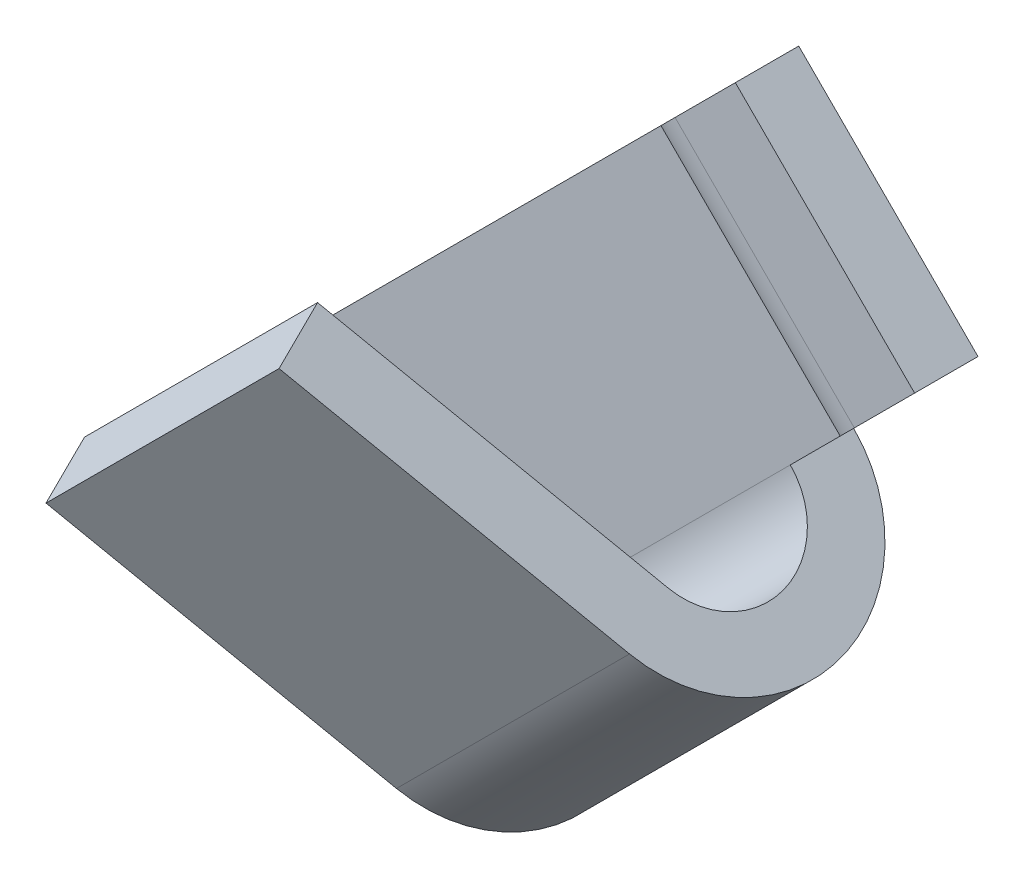
ISO-10303-21;
HEADER;
FILE_DESCRIPTION(('STEP AP214'),'2;1');
FILE_NAME('part.step','',(''),(''),'','','');
FILE_SCHEMA(('AUTOMOTIVE_DESIGN { 1 0 10303 214 1 1 1 1 }'));
ENDSEC;
DATA;
#1=APPLICATION_CONTEXT('core data for automotive mechanical design processes');
#2=APPLICATION_PROTOCOL_DEFINITION('international standard','automotive_design',2000,#1);
#3=PRODUCT_CONTEXT('',#1,'mechanical');
#4=PRODUCT('Part','Part','',(#3));
#5=PRODUCT_RELATED_PRODUCT_CATEGORY('part','',(#4));
#6=PRODUCT_DEFINITION_FORMATION('','',#4);
#7=PRODUCT_DEFINITION_CONTEXT('part definition',#1,'design');
#8=PRODUCT_DEFINITION('design','',#6,#7);
#9=PRODUCT_DEFINITION_SHAPE('','',#8);
#10=(LENGTH_UNIT() NAMED_UNIT(*) SI_UNIT(.MILLI.,.METRE.));
#11=(NAMED_UNIT(*) PLANE_ANGLE_UNIT() SI_UNIT($,.RADIAN.));
#12=(NAMED_UNIT(*) SI_UNIT($,.STERADIAN.) SOLID_ANGLE_UNIT());
#13=UNCERTAINTY_MEASURE_WITH_UNIT(LENGTH_MEASURE(1.E-05),#10,'distance_accuracy_value','');
#14=(GEOMETRIC_REPRESENTATION_CONTEXT(3) GLOBAL_UNCERTAINTY_ASSIGNED_CONTEXT((#13)) GLOBAL_UNIT_ASSIGNED_CONTEXT((#10,
#11,#12)) REPRESENTATION_CONTEXT('',''));
#15=CARTESIAN_POINT('',(0.,0.,0.));
#16=DIRECTION('',(0.,0.,1.));
#17=DIRECTION('',(1.,0.,0.));
#18=AXIS2_PLACEMENT_3D('',#15,#16,#17);
#19=CARTESIAN_POINT('',(-5.307476720611,-6.014583501798,0.338229496468));
#20=DIRECTION('',(-0.707106781186548,-0.707106781186548,0.));
#21=DIRECTION('',(0.707106781186548,-0.707106781186548,0.));
#22=AXIS2_PLACEMENT_3D('',#19,#20,#21);
#23=CYLINDRICAL_SURFACE('',#22,0.3);
#24=DIRECTION('',(0.707106781186932,0.707106781186163,0.));
#25=VECTOR('',#24,1.);
#26=CARTESIAN_POINT('',(-5.651394788552,-6.358501569738,0.03822949646826));
#27=LINE('',#26,#25);
#28=CARTESIAN_POINT('',(-5.651394788552,-6.358501569738,0.03822949646813));
#29=VERTEX_POINT('',#28);
#30=CARTESIAN_POINT('',(-4.732155973009,-5.439262754196,0.0382294964681299));
#31=VERTEX_POINT('',#30);
#32=EDGE_CURVE('E144',#29,#31,#27,.T.);
#33=ORIENTED_EDGE('',*,*,#32,.F.);
#34=CARTESIAN_POINT('',(-5.6513947885515,-6.3585015697385,0.338229496468));
#35=DIRECTION('',(-0.707106781186548,-0.707106781186548,0.));
#36=DIRECTION('',(0.707106781186548,-0.707106781186548,0.));
#37=AXIS2_PLACEMENT_3D('',#34,#35,#36);
#38=CIRCLE('',#37,0.3);
#39=CARTESIAN_POINT('',(-5.56174391693263,-6.44815244135737,0.610121832579192));
#40=VERTEX_POINT('',#39);
#41=EDGE_CURVE('E20',#40,#29,#38,.F.);
#42=ORIENTED_EDGE('',*,*,#41,.F.);
#43=DIRECTION('',(-0.707106781186864,-0.707106781186231,2.08667218119905E-13));
#44=VECTOR('',#43,1.);
#45=CARTESIAN_POINT('',(-4.64250510138985,-5.52891362581515,0.610121832579443));
#46=LINE('',#45,#44);
#47=CARTESIAN_POINT('',(-4.64250510138993,-5.52891362581507,0.610121832579221));
#48=VERTEX_POINT('',#47);
#49=EDGE_CURVE('E141',#48,#40,#46,.T.);
#50=ORIENTED_EDGE('',*,*,#49,.F.);
#51=CARTESIAN_POINT('',(-4.732155973009,-5.439262754196,0.338229496468));
#52=DIRECTION('',(-0.707106781186548,-0.707106781186548,0.));
#53=DIRECTION('',(0.707106781186548,-0.707106781186548,0.));
#54=AXIS2_PLACEMENT_3D('',#51,#52,#53);
#55=CIRCLE('',#54,0.3);
#56=EDGE_CURVE('E163',#31,#48,#55,.T.);
#57=ORIENTED_EDGE('',*,*,#56,.F.);
#58=EDGE_LOOP('',(#33,#42,#50,#57));
#59=FACE_BOUND('',#58,.T.);
#60=ADVANCED_FACE('F17',(#59),#23,.F.);
#61=CARTESIAN_POINT('',(-6.394857213605,-5.615039144685,1.159525572842));
#62=DIRECTION('',(-0.298836238729927,0.298836238729927,-0.906307787036777));
#63=DIRECTION('',(0.,0.949705125315019,0.313145613014751));
#64=AXIS2_PLACEMENT_3D('',#61,#62,#63);
#65=PLANE('',#64);
#66=DIRECTION('',(0.707106781186548,0.707106781186548,0.));
#67=VECTOR('',#66,1.);
#68=CARTESIAN_POINT('',(-5.47561839806291,-4.69580032914209,1.15952557284227));
#69=LINE('',#68,#67);
#70=CARTESIAN_POINT('',(-6.39485721360514,-5.61503914468486,1.15952557284209));
#71=VERTEX_POINT('',#70);
#72=CARTESIAN_POINT('',(-5.47561839806297,-4.69580032914203,1.15952557284209));
#73=VERTEX_POINT('',#72);
#74=EDGE_CURVE('E158',#71,#73,#69,.T.);
#75=ORIENTED_EDGE('',*,*,#74,.T.);
#76=DIRECTION('',(-0.640856382055835,0.640856382055835,0.422618261740559));
#77=VECTOR('',#76,1.);
#78=CARTESIAN_POINT('',(-4.64250510139,-5.528913625815,0.610121832579));
#79=LINE('',#78,#77);
#80=EDGE_CURVE('E156',#48,#73,#79,.T.);
#81=ORIENTED_EDGE('',*,*,#80,.F.);
#82=ORIENTED_EDGE('',*,*,#49,.T.);
#83=DIRECTION('',(0.640856382055697,-0.640856382055697,-0.422618261740976));
#84=VECTOR('',#83,1.);
#85=CARTESIAN_POINT('',(-6.394857213605,-5.615039144685,1.159525572842));
#86=LINE('',#85,#84);
#87=EDGE_CURVE('E153',#71,#40,#86,.T.);
#88=ORIENTED_EDGE('',*,*,#87,.F.);
#89=EDGE_LOOP('',(#75,#81,#82,#88));
#90=FACE_BOUND('',#89,.T.);
#91=ADVANCED_FACE('F152',(#90),#65,.T.);
#92=CARTESIAN_POINT('',(-5.475618398063,-4.695800329142,1.159525572842));
#93=DIRECTION('',(0.640856382055745,-0.640856382055745,-0.422618261740832));
#94=DIRECTION('',(0.707106781186548,0.707106781186548,0.));
#95=AXIS2_PLACEMENT_3D('',#92,#93,#94);
#96=PLANE('',#95);
#97=DIRECTION('',(-0.298836238728551,0.298836238728551,-0.906307787037684));
#98=VECTOR('',#97,1.);
#99=CARTESIAN_POINT('',(-6.320148153923,-5.689748204367,1.386102519601));
#100=LINE('',#99,#98);
#101=CARTESIAN_POINT('',(-6.320148153923,-5.689748204367,1.386102519601));
#102=VERTEX_POINT('',#101);
#103=EDGE_CURVE('E162',#102,#71,#100,.T.);
#104=ORIENTED_EDGE('',*,*,#103,.F.);
#105=DIRECTION('',(-0.707106781186548,-0.707106781186547,0.));
#106=VECTOR('',#105,1.);
#107=CARTESIAN_POINT('',(-5.400909338381,-4.770509388825,1.386102519601));
#108=LINE('',#107,#106);
#109=CARTESIAN_POINT('',(-5.40090933838083,-4.77050938882483,1.386102519601));
#110=VERTEX_POINT('',#109);
#111=EDGE_CURVE('E177',#110,#102,#108,.T.);
#112=ORIENTED_EDGE('',*,*,#111,.F.);
#113=DIRECTION('',(0.298836238730198,-0.298836238730198,0.906307787036598));
#114=VECTOR('',#113,1.);
#115=CARTESIAN_POINT('',(-5.475618398063,-4.695800329142,1.159525572842));
#116=LINE('',#115,#114);
#117=EDGE_CURVE('E231',#73,#110,#116,.T.);
#118=ORIENTED_EDGE('',*,*,#117,.F.);
#119=ORIENTED_EDGE('',*,*,#74,.F.);
#120=EDGE_LOOP('',(#104,#112,#118,#119));
#121=FACE_BOUND('',#120,.T.);
#122=ADVANCED_FACE('F317',(#121),#96,.F.);
#123=CARTESIAN_POINT('',(-5.934237501026,-6.641344282213,0.03822949646826));
#124=DIRECTION('',(0.,0.,1.));
#125=DIRECTION('',(1.,0.,0.));
#126=AXIS2_PLACEMENT_3D('',#123,#124,#125);
#127=PLANE('',#126);
#128=DIRECTION('',(0.707106781186549,0.707106781186546,0.));
#129=VECTOR('',#128,1.);
#130=CARTESIAN_POINT('',(-4.732155973009,-5.439262754196,0.03822949646826));
#131=LINE('',#130,#129);
#132=CARTESIAN_POINT('',(-4.520023938653,-5.22713071984,0.03822949646813));
#133=VERTEX_POINT('',#132);
#134=EDGE_CURVE('E210',#31,#133,#131,.T.);
#135=ORIENTED_EDGE('',*,*,#134,.T.);
#136=DIRECTION('',(0.707106781186548,-0.707106781186548,0.));
#137=VECTOR('',#136,1.);
#138=CARTESIAN_POINT('',(-4.520023938653,-5.22713071984,0.038229496468));
#139=LINE('',#138,#137);
#140=CARTESIAN_POINT('',(-5.22713071984,-4.520023938653,0.0382294964681299));
#141=VERTEX_POINT('',#140);
#142=EDGE_CURVE('E198',#133,#141,#139,.F.);
#143=ORIENTED_EDGE('',*,*,#142,.T.);
#144=DIRECTION('',(-0.707106781186548,-0.707106781186548,0.));
#145=VECTOR('',#144,1.);
#146=CARTESIAN_POINT('',(-3.207106781187,-2.5,0.0382294964682599));
#147=LINE('',#146,#145);
#148=CARTESIAN_POINT('',(-6.641344282213,-5.934237501026,0.03822949646826));
#149=VERTEX_POINT('',#148);
#150=EDGE_CURVE('E282',#149,#141,#147,.F.);
#151=ORIENTED_EDGE('',*,*,#150,.F.);
#152=DIRECTION('',(0.707106781186548,-0.707106781186548,0.));
#153=VECTOR('',#152,1.);
#154=CARTESIAN_POINT('',(-6.641344282213,-5.934237501026,0.03822949646826));
#155=LINE('',#154,#153);
#156=CARTESIAN_POINT('',(-5.934237501026,-6.641344282213,0.03822949646826));
#157=VERTEX_POINT('',#156);
#158=EDGE_CURVE('E218',#149,#157,#155,.T.);
#159=ORIENTED_EDGE('',*,*,#158,.T.);
#160=DIRECTION('',(0.707106781185297,0.707106781187798,0.));
#161=VECTOR('',#160,1.);
#162=CARTESIAN_POINT('',(-5.934237501026,-6.641344282213,0.03822949646826));
#163=LINE('',#162,#161);
#164=EDGE_CURVE('E221',#157,#29,#163,.T.);
#165=ORIENTED_EDGE('',*,*,#164,.T.);
#166=ORIENTED_EDGE('',*,*,#32,.T.);
#167=EDGE_LOOP('',(#135,#143,#151,#159,#165,#166));
#168=FACE_BOUND('',#167,.T.);
#169=ADVANCED_FACE('F354',(#168),#127,.T.);
#170=CARTESIAN_POINT('',(-7.5,-1.267083322705,21.289254270812));
#171=DIRECTION('',(-0.707106781186548,-0.707106781186548,0.));
#172=DIRECTION('',(0.707106781186548,-0.707106781186548,0.));
#173=AXIS2_PLACEMENT_3D('',#170,#171,#172);
#174=PLANE('',#173);
#175=DIRECTION('',(0.707106781186548,-0.707106781186548,0.));
#176=VECTOR('',#175,1.);
#177=CARTESIAN_POINT('',(-4.737095051946,-4.029988270759,0.));
#178=LINE('',#177,#176);
#179=CARTESIAN_POINT('',(-4.737095051946,-4.029988270759,0.));
#180=VERTEX_POINT('',#179);
#181=CARTESIAN_POINT('',(-4.029988270759,-4.737095051946,2.14708170224546E-13));
#182=VERTEX_POINT('',#181);
#183=EDGE_CURVE('E184',#180,#182,#178,.T.);
#184=ORIENTED_EDGE('',*,*,#183,.F.);
#185=DIRECTION('',(0.,0.,1.));
#186=VECTOR('',#185,1.);
#187=CARTESIAN_POINT('',(-4.737095051946,-4.029988270759,0.25));
#188=LINE('',#187,#186);
#189=CARTESIAN_POINT('',(-4.737095051946,-4.029988270759,0.25));
#190=VERTEX_POINT('',#189);
#191=EDGE_CURVE('E176',#190,#180,#188,.F.);
#192=ORIENTED_EDGE('',*,*,#191,.F.);
#193=DIRECTION('',(0.707106781186548,-0.707106781186548,0.));
#194=VECTOR('',#193,1.);
#195=CARTESIAN_POINT('',(-4.737095051946,-4.029988270759,0.25));
#196=LINE('',#195,#194);
#197=CARTESIAN_POINT('',(-4.029988270759,-4.737095051946,0.25));
#198=VERTEX_POINT('',#197);
#199=EDGE_CURVE('E208',#190,#198,#196,.T.);
#200=ORIENTED_EDGE('',*,*,#199,.T.);
#201=DIRECTION('',(0.,0.,1.));
#202=VECTOR('',#201,1.);
#203=CARTESIAN_POINT('',(-4.029988270759,-4.737095051946,0.25));
#204=LINE('',#203,#202);
#205=EDGE_CURVE('E190',#182,#198,#204,.T.);
#206=ORIENTED_EDGE('',*,*,#205,.F.);
#207=EDGE_LOOP('',(#184,#192,#200,#206));
#208=FACE_BOUND('',#207,.T.);
#209=ADVANCED_FACE('F375',(#208),#174,.F.);
#210=CARTESIAN_POINT('',(3.207106781187,-2.5,0.25));
#211=DIRECTION('',(0.,0.,-1.));
#212=DIRECTION('',(-1.,0.,0.));
#213=AXIS2_PLACEMENT_3D('',#210,#211,#212);
#214=PLANE('',#213);
#215=ORIENTED_EDGE('',*,*,#199,.F.);
#216=DIRECTION('',(-0.707106781186548,-0.707106781186548,0.));
#217=VECTOR('',#216,1.);
#218=CARTESIAN_POINT('',(-3.207106781187,-2.5,0.25));
#219=LINE('',#218,#217);
#220=CARTESIAN_POINT('',(-4.974873734153,-4.267766952966,0.250000000000161));
#221=VERTEX_POINT('',#220);
#222=EDGE_CURVE('E274',#221,#190,#219,.F.);
#223=ORIENTED_EDGE('',*,*,#222,.F.);
#224=DIRECTION('',(0.707106781186548,-0.707106781186548,0.));
#225=VECTOR('',#224,1.);
#226=CARTESIAN_POINT('',(-4.267766952966,-4.974873734153,0.250000000000322));
#227=LINE('',#226,#225);
#228=CARTESIAN_POINT('',(-4.267766952966,-4.974873734153,0.250000000000161));
#229=VERTEX_POINT('',#228);
#230=EDGE_CURVE('E206',#229,#221,#227,.F.);
#231=ORIENTED_EDGE('',*,*,#230,.F.);
#232=DIRECTION('',(0.707106781186548,0.707106781186548,0.));
#233=VECTOR('',#232,1.);
#234=CARTESIAN_POINT('',(-4.267766952966,-4.974873734153,0.25));
#235=LINE('',#234,#233);
#236=EDGE_CURVE('E193',#198,#229,#235,.F.);
#237=ORIENTED_EDGE('',*,*,#236,.F.);
#238=EDGE_LOOP('',(#215,#223,#231,#237));
#239=FACE_BOUND('',#238,.T.);
#240=ADVANCED_FACE('F373',(#239),#214,.F.);
#241=CARTESIAN_POINT('',(-4.267766952966,-4.974873734153,3.21818309848E-13));
#242=DIRECTION('',(0.707106781186548,-0.707106781186548,0.));
#243=DIRECTION('',(0.707106781186548,0.707106781186548,0.));
#244=AXIS2_PLACEMENT_3D('',#241,#242,#243);
#245=CYLINDRICAL_SURFACE('',#244,0.25);
#246=CARTESIAN_POINT('',(-4.267766952966,-4.974873734153,3.21818309848E-13));
#247=DIRECTION('',(0.707106781186548,-0.707106781186548,0.));
#248=DIRECTION('',(0.707106781186548,0.707106781186548,0.));
#249=AXIS2_PLACEMENT_3D('',#246,#247,#248);
#250=CIRCLE('',#249,0.25);
#251=CARTESIAN_POINT('',(-4.39276695296619,-5.09987373415319,0.176776695296735));
#252=VERTEX_POINT('',#251);
#253=EDGE_CURVE('E269',#229,#252,#250,.T.);
#254=ORIENTED_EDGE('',*,*,#253,.F.);
#255=ORIENTED_EDGE('',*,*,#230,.T.);
#256=CARTESIAN_POINT('',(-4.974873734153,-4.267766952966,3.21818309848E-13));
#257=DIRECTION('',(0.707106781186548,-0.707106781186548,0.));
#258=DIRECTION('',(0.707106781186548,0.707106781186548,0.));
#259=AXIS2_PLACEMENT_3D('',#256,#257,#258);
#260=CIRCLE('',#259,0.25);
#261=CARTESIAN_POINT('',(-5.09987373415319,-4.39276695296619,0.176776695296735));
#262=VERTEX_POINT('',#261);
#263=EDGE_CURVE('E275',#262,#221,#260,.F.);
#264=ORIENTED_EDGE('',*,*,#263,.F.);
#265=DIRECTION('',(-0.707106781186547,0.707106781186547,0.));
#266=VECTOR('',#265,1.);
#267=CARTESIAN_POINT('',(-4.392766952966,-5.099873734153,0.176776695297));
#268=LINE('',#267,#266);
#269=EDGE_CURVE('E203',#252,#262,#268,.T.);
#270=ORIENTED_EDGE('',*,*,#269,.F.);
#271=EDGE_LOOP('',(#254,#255,#264,#270));
#272=FACE_BOUND('',#271,.T.);
#273=ADVANCED_FACE('F368',(#272),#245,.T.);
#274=CARTESIAN_POINT('',(-4.392766952966,-5.099873734153,0.176776695297));
#275=DIRECTION('',(-0.500000000001047,-0.500000000001047,0.707106781185067));
#276=DIRECTION('',(0.816496580926586,0.,0.577350269191238));
#277=AXIS2_PLACEMENT_3D('',#274,#275,#276);
#278=PLANE('',#277);
#279=DIRECTION('',(-0.499999999998558,-0.499999999998558,-0.707106781188587));
#280=VECTOR('',#279,1.);
#281=CARTESIAN_POINT('',(-4.392766952966,-5.099873734153,0.176776695297));
#282=LINE('',#281,#280);
#283=CARTESIAN_POINT('',(-4.47002393865293,-5.17713071983993,0.0675188183496497));
#284=VERTEX_POINT('',#283);
#285=EDGE_CURVE('E268',#252,#284,#282,.T.);
#286=ORIENTED_EDGE('',*,*,#285,.F.);
#287=ORIENTED_EDGE('',*,*,#269,.T.);
#288=DIRECTION('',(0.499999999998558,0.499999999998558,0.707106781188587));
#289=VECTOR('',#288,1.);
#290=CARTESIAN_POINT('',(-5.17713071984,-4.470023938653,0.0675188183497499));
#291=LINE('',#290,#289);
#292=CARTESIAN_POINT('',(-5.17713071983993,-4.47002393865293,0.0675188183496497));
#293=VERTEX_POINT('',#292);
#294=EDGE_CURVE('E278',#293,#262,#291,.T.);
#295=ORIENTED_EDGE('',*,*,#294,.F.);
#296=DIRECTION('',(0.707106781186548,-0.707106781186548,0.));
#297=VECTOR('',#296,1.);
#298=CARTESIAN_POINT('',(-4.47002393865286,-5.17713071983986,0.0675188183495473));
#299=LINE('',#298,#297);
#300=EDGE_CURVE('E201',#293,#284,#299,.T.);
#301=ORIENTED_EDGE('',*,*,#300,.T.);
#302=EDGE_LOOP('',(#286,#287,#295,#301));
#303=FACE_BOUND('',#302,.T.);
#304=ADVANCED_FACE('F363',(#303),#278,.T.);
#305=CARTESIAN_POINT('',(-4.520023938653,-5.22713071984,0.138229496468));
#306=DIRECTION('',(0.707106781186548,-0.707106781186548,0.));
#307=DIRECTION('',(0.707106781186548,0.707106781186548,0.));
#308=AXIS2_PLACEMENT_3D('',#305,#306,#307);
#309=CYLINDRICAL_SURFACE('',#308,0.1);
#310=ORIENTED_EDGE('',*,*,#142,.F.);
#311=CARTESIAN_POINT('',(-4.520023938653,-5.22713071984,0.138229496468));
#312=DIRECTION('',(0.707106781186548,-0.707106781186548,0.));
#313=DIRECTION('',(0.707106781186548,0.707106781186548,0.));
#314=AXIS2_PLACEMENT_3D('',#311,#312,#313);
#315=CIRCLE('',#314,0.1);
#316=EDGE_CURVE('E265',#284,#133,#315,.F.);
#317=ORIENTED_EDGE('',*,*,#316,.F.);
#318=ORIENTED_EDGE('',*,*,#300,.F.);
#319=CARTESIAN_POINT('',(-5.22713071984,-4.520023938653,0.138229496468));
#320=DIRECTION('',(0.707106781186548,-0.707106781186548,0.));
#321=DIRECTION('',(0.707106781186548,0.707106781186548,0.));
#322=AXIS2_PLACEMENT_3D('',#319,#320,#321);
#323=CIRCLE('',#322,0.1);
#324=EDGE_CURVE('E279',#141,#293,#323,.T.);
#325=ORIENTED_EDGE('',*,*,#324,.F.);
#326=EDGE_LOOP('',(#310,#317,#318,#325));
#327=FACE_BOUND('',#326,.T.);
#328=ADVANCED_FACE('F358',(#327),#309,.F.);
#329=CARTESIAN_POINT('',(-4.311397712254,-5.018504493441,-0.02555830705379));
#330=DIRECTION('',(0.500000000001047,0.500000000001047,-0.707106781185067));
#331=DIRECTION('',(-0.816496580926586,0.,-0.577350269191238));
#332=AXIS2_PLACEMENT_3D('',#329,#330,#331);
#333=PLANE('',#332);
#334=DIRECTION('',(0.499999999997506,0.499999999997506,0.707106781190074));
#335=VECTOR('',#334,1.);
#336=CARTESIAN_POINT('',(-4.3912929238255,-5.0983997050125,-0.138547198828));
#337=LINE('',#336,#335);
#338=CARTESIAN_POINT('',(-4.39129292382543,-5.09839970501193,-0.138547198827513));
#339=VERTEX_POINT('',#338);
#340=CARTESIAN_POINT('',(-4.31139771225386,-5.01850449344086,-0.0255583070538812));
#341=VERTEX_POINT('',#340);
#342=EDGE_CURVE('E260',#339,#341,#337,.T.);
#343=ORIENTED_EDGE('',*,*,#342,.F.);
#344=DIRECTION('',(0.707106781186548,-0.707106781186548,0.));
#345=VECTOR('',#344,1.);
#346=CARTESIAN_POINT('',(-4.39129292382604,-5.09839970501204,-0.138547198827938));
#347=LINE('',#346,#345);
#348=CARTESIAN_POINT('',(-5.09839970501193,-4.39129292382543,-0.138547198827513));
#349=VERTEX_POINT('',#348);
#350=EDGE_CURVE('E194',#349,#339,#347,.T.);
#351=ORIENTED_EDGE('',*,*,#350,.F.);
#352=DIRECTION('',(-0.499999999997502,-0.499999999997507,-0.707106781190076));
#353=VECTOR('',#352,1.);
#354=CARTESIAN_POINT('',(-5.018504493441,-4.311397712254,-0.0255583070537901));
#355=LINE('',#354,#353);
#356=CARTESIAN_POINT('',(-5.01850449344086,-4.31139771225386,-0.0255583070538811));
#357=VERTEX_POINT('',#356);
#358=EDGE_CURVE('E285',#357,#349,#355,.T.);
#359=ORIENTED_EDGE('',*,*,#358,.F.);
#360=DIRECTION('',(0.707106781186548,-0.707106781186548,0.));
#361=VECTOR('',#360,1.);
#362=CARTESIAN_POINT('',(-4.3113977122538,-5.0185044934408,-0.0255583070540773));
#363=LINE('',#362,#361);
#364=EDGE_CURVE('E187',#357,#341,#363,.T.);
#365=ORIENTED_EDGE('',*,*,#364,.T.);
#366=EDGE_LOOP('',(#343,#351,#359,#365));
#367=FACE_BOUND('',#366,.T.);
#368=ADVANCED_FACE('F388',(#367),#333,.T.);
#369=CARTESIAN_POINT('',(-4.267766952966,-4.974873734153,-0.08726151857469));
#370=DIRECTION('',(0.707106781186548,-0.707106781186548,0.));
#371=DIRECTION('',(0.707106781186548,0.707106781186548,0.));
#372=AXIS2_PLACEMENT_3D('',#369,#370,#371);
#373=CYLINDRICAL_SURFACE('',#372,0.08726151857501);
#374=DIRECTION('',(-0.707106781186547,0.707106781186547,0.));
#375=VECTOR('',#374,1.);
#376=CARTESIAN_POINT('',(-4.267766952966,-4.974873734153,0.));
#377=LINE('',#376,#375);
#378=CARTESIAN_POINT('',(-4.267766952966,-4.974873734153,1.61071785249878E-13));
#379=VERTEX_POINT('',#378);
#380=CARTESIAN_POINT('',(-4.974873734153,-4.267766952966,0.));
#381=VERTEX_POINT('',#380);
#382=EDGE_CURVE('E149',#379,#381,#377,.T.);
#383=ORIENTED_EDGE('',*,*,#382,.F.);
#384=CARTESIAN_POINT('',(-4.267766952966,-4.974873734153,-0.08726151857469));
#385=DIRECTION('',(0.707106781186548,-0.707106781186548,0.));
#386=DIRECTION('',(0.707106781186548,0.707106781186548,0.));
#387=AXIS2_PLACEMENT_3D('',#384,#385,#386);
#388=CIRCLE('',#387,0.08726151857501);
#389=EDGE_CURVE('E257',#341,#379,#388,.F.);
#390=ORIENTED_EDGE('',*,*,#389,.F.);
#391=ORIENTED_EDGE('',*,*,#364,.F.);
#392=CARTESIAN_POINT('',(-4.974873734153,-4.267766952966,-0.08726151857469));
#393=DIRECTION('',(0.707106781186548,-0.707106781186548,0.));
#394=DIRECTION('',(0.707106781186548,0.707106781186548,0.));
#395=AXIS2_PLACEMENT_3D('',#392,#393,#394);
#396=CIRCLE('',#395,0.08726151857501);
#397=EDGE_CURVE('E283',#381,#357,#396,.T.);
#398=ORIENTED_EDGE('',*,*,#397,.F.);
#399=EDGE_LOOP('',(#383,#390,#391,#398));
#400=FACE_BOUND('',#399,.T.);
#401=ADVANCED_FACE('F382',(#400),#373,.F.);
#402=CARTESIAN_POINT('',(3.207106781187,-2.5,0.));
#403=DIRECTION('',(0.,0.,-1.));
#404=DIRECTION('',(-1.,0.,0.));
#405=AXIS2_PLACEMENT_3D('',#402,#403,#404);
#406=PLANE('',#405);
#407=ORIENTED_EDGE('',*,*,#382,.T.);
#408=DIRECTION('',(-0.707106781186548,-0.707106781186548,0.));
#409=VECTOR('',#408,1.);
#410=CARTESIAN_POINT('',(-3.207106781187,-2.5,0.));
#411=LINE('',#410,#409);
#412=EDGE_CURVE('E215',#180,#381,#411,.T.);
#413=ORIENTED_EDGE('',*,*,#412,.F.);
#414=ORIENTED_EDGE('',*,*,#183,.T.);
#415=DIRECTION('',(0.707106781186548,0.707106781186548,0.));
#416=VECTOR('',#415,1.);
#417=CARTESIAN_POINT('',(-4.267766952966,-4.974873734153,3.22116465445443E-13));
#418=LINE('',#417,#416);
#419=EDGE_CURVE('E256',#379,#182,#418,.T.);
#420=ORIENTED_EDGE('',*,*,#419,.F.);
#421=EDGE_LOOP('',(#407,#413,#414,#420));
#422=FACE_BOUND('',#421,.T.);
#423=ADVANCED_FACE('F379',(#422),#406,.T.);
#424=CARTESIAN_POINT('',(-5.48703485725,-6.52286150104,0.836698779338));
#425=DIRECTION('',(-0.707106781186548,-0.707106781186548,0.));
#426=DIRECTION('',(0.707106781186548,-0.707106781186548,0.));
#427=AXIS2_PLACEMENT_3D('',#424,#425,#426);
#428=PLANE('',#427);
#429=ORIENTED_EDGE('',*,*,#103,.T.);
#430=ORIENTED_EDGE('',*,*,#87,.T.);
#431=ORIENTED_EDGE('',*,*,#41,.T.);
#432=DIRECTION('',(0.,0.,1.));
#433=VECTOR('',#432,1.);
#434=CARTESIAN_POINT('',(-5.651394788552,-6.358501569738,0.836698779338));
#435=LINE('',#434,#433);
#436=CARTESIAN_POINT('',(-5.65139478855225,-6.35850156973825,-0.211770503531));
#437=VERTEX_POINT('',#436);
#438=EDGE_CURVE('E148',#29,#437,#435,.F.);
#439=ORIENTED_EDGE('',*,*,#438,.T.);
#440=CARTESIAN_POINT('',(-5.651394788552,-6.358501569739,0.338229496468));
#441=DIRECTION('',(-0.707106781186548,-0.707106781186548,0.));
#442=DIRECTION('',(0.707106781186548,-0.707106781186548,0.));
#443=AXIS2_PLACEMENT_3D('',#440,#441,#442);
#444=CIRCLE('',#443,0.549999999999);
#445=CARTESIAN_POINT('',(-5.48703485725085,-6.52286150104015,0.836698779337883));
#446=VERTEX_POINT('',#445);
#447=EDGE_CURVE('E253',#446,#437,#444,.F.);
#448=ORIENTED_EDGE('',*,*,#447,.F.);
#449=DIRECTION('',(0.640856382055493,-0.640856382056264,-0.422618261740426));
#450=VECTOR('',#449,1.);
#451=CARTESIAN_POINT('',(-6.320148153923,-5.689748204367,1.386102519601));
#452=LINE('',#451,#450);
#453=EDGE_CURVE('E173',#102,#446,#452,.T.);
#454=ORIENTED_EDGE('',*,*,#453,.F.);
#455=EDGE_LOOP('',(#429,#430,#431,#439,#448,#454));
#456=FACE_BOUND('',#455,.T.);
#457=ADVANCED_FACE('F160',(#456),#428,.T.);
#458=CARTESIAN_POINT('',(-4.64250510139,-5.528913625815,0.610121832579));
#459=DIRECTION('',(0.707106781186548,0.707106781186548,0.));
#460=DIRECTION('',(-0.707106781186548,0.707106781186548,0.));
#461=AXIS2_PLACEMENT_3D('',#458,#459,#460);
#462=PLANE('',#461);
#463=CARTESIAN_POINT('',(-4.732155973009,-5.439262754196,0.338229496468));
#464=DIRECTION('',(-0.707106781186548,-0.707106781186548,0.));
#465=DIRECTION('',(0.707106781186548,-0.707106781186548,0.));
#466=AXIS2_PLACEMENT_3D('',#463,#464,#465);
#467=CIRCLE('',#466,0.549999999999);
#468=CARTESIAN_POINT('',(-4.732155973009,-5.439262754196,-0.211770503531));
#469=VERTEX_POINT('',#468);
#470=CARTESIAN_POINT('',(-4.56779604170785,-5.60362268549715,0.836698779337882));
#471=VERTEX_POINT('',#470);
#472=EDGE_CURVE('E249',#469,#471,#467,.T.);
#473=ORIENTED_EDGE('',*,*,#472,.F.);
#474=DIRECTION('',(0.,0.,1.));
#475=VECTOR('',#474,1.);
#476=CARTESIAN_POINT('',(-4.732155973009,-5.439262754196,0.25));
#477=LINE('',#476,#475);
#478=EDGE_CURVE('E264',#31,#469,#477,.F.);
#479=ORIENTED_EDGE('',*,*,#478,.F.);
#480=ORIENTED_EDGE('',*,*,#56,.T.);
#481=ORIENTED_EDGE('',*,*,#80,.T.);
#482=ORIENTED_EDGE('',*,*,#117,.T.);
#483=DIRECTION('',(-0.640856382056263,0.640856382055494,0.422618261740426));
#484=VECTOR('',#483,1.);
#485=CARTESIAN_POINT('',(-4.56779604170785,-5.60362268549715,0.836698779338443));
#486=LINE('',#485,#484);
#487=EDGE_CURVE('E228',#471,#110,#486,.T.);
#488=ORIENTED_EDGE('',*,*,#487,.F.);
#489=EDGE_LOOP('',(#473,#479,#480,#481,#482,#488));
#490=FACE_BOUND('',#489,.T.);
#491=ADVANCED_FACE('F312',(#490),#462,.T.);
#492=CARTESIAN_POINT('',(-5.400909338381,-4.770509388825,1.386102519601));
#493=DIRECTION('',(0.298836238729927,-0.298836238729927,0.906307787036777));
#494=DIRECTION('',(0.,-0.949705125315019,-0.313145613014751));
#495=AXIS2_PLACEMENT_3D('',#492,#493,#494);
#496=PLANE('',#495);
#497=ORIENTED_EDGE('',*,*,#111,.T.);
#498=ORIENTED_EDGE('',*,*,#453,.T.);
#499=DIRECTION('',(-0.707106781186548,-0.707106781186548,0.));
#500=VECTOR('',#499,1.);
#501=CARTESIAN_POINT('',(-5.14311678931016,-6.17894343309884,0.83669877933753));
#502=LINE('',#501,#500);
#503=EDGE_CURVE('E252',#471,#446,#502,.T.);
#504=ORIENTED_EDGE('',*,*,#503,.F.);
#505=ORIENTED_EDGE('',*,*,#487,.T.);
#506=EDGE_LOOP('',(#497,#498,#504,#505));
#507=FACE_BOUND('',#506,.T.);
#508=ADVANCED_FACE('F309',(#507),#496,.T.);
#509=CARTESIAN_POINT('',(-3.207106781187,-2.5,0.25));
#510=DIRECTION('',(-0.707106781186548,0.707106781186548,0.));
#511=DIRECTION('',(-0.707106781186548,-0.707106781186548,0.));
#512=AXIS2_PLACEMENT_3D('',#509,#510,#511);
#513=PLANE('',#512);
#514=ORIENTED_EDGE('',*,*,#263,.T.);
#515=ORIENTED_EDGE('',*,*,#222,.T.);
#516=ORIENTED_EDGE('',*,*,#191,.T.);
#517=ORIENTED_EDGE('',*,*,#412,.T.);
#518=ORIENTED_EDGE('',*,*,#397,.T.);
#519=ORIENTED_EDGE('',*,*,#358,.T.);
#520=CARTESIAN_POINT('',(-5.223399705012,-4.516292923826,0.03822949646876));
#521=DIRECTION('',(0.707106781186548,-0.707106781186548,0.));
#522=DIRECTION('',(0.707106781186548,0.707106781186548,0.));
#523=AXIS2_PLACEMENT_3D('',#520,#521,#522);
#524=CIRCLE('',#523,0.25);
#525=CARTESIAN_POINT('',(-5.223399705012,-4.516292923826,-0.211770503531));
#526=VERTEX_POINT('',#525);
#527=EDGE_CURVE('E200',#526,#349,#524,.T.);
#528=ORIENTED_EDGE('',*,*,#527,.F.);
#529=DIRECTION('',(0.707106781186797,0.707106781186298,0.));
#530=VECTOR('',#529,1.);
#531=CARTESIAN_POINT('',(-6.641344282213,-5.934237501026,-0.211770503531));
#532=LINE('',#531,#530);
#533=CARTESIAN_POINT('',(-6.641344282213,-5.934237501026,-0.211770503531));
#534=VERTEX_POINT('',#533);
#535=EDGE_CURVE('E245',#534,#526,#532,.T.);
#536=ORIENTED_EDGE('',*,*,#535,.F.);
#537=DIRECTION('',(0.,0.,1.));
#538=VECTOR('',#537,1.);
#539=CARTESIAN_POINT('',(-6.641344282213,-5.934237501026,0.03822949646826));
#540=LINE('',#539,#538);
#541=EDGE_CURVE('E246',#149,#534,#540,.F.);
#542=ORIENTED_EDGE('',*,*,#541,.F.);
#543=ORIENTED_EDGE('',*,*,#150,.T.);
#544=ORIENTED_EDGE('',*,*,#324,.T.);
#545=ORIENTED_EDGE('',*,*,#294,.T.);
#546=EDGE_LOOP('',(#514,#515,#516,#517,#518,#519,#528,#536,#542,#543,#544,#545));
#547=FACE_BOUND('',#546,.T.);
#548=ADVANCED_FACE('F351',(#547),#513,.T.);
#549=CARTESIAN_POINT('',(-4.516292923826,-5.223399705012,0.03822949646876));
#550=DIRECTION('',(0.707106781186548,-0.707106781186548,0.));
#551=DIRECTION('',(0.707106781186548,0.707106781186548,0.));
#552=AXIS2_PLACEMENT_3D('',#549,#550,#551);
#553=CYLINDRICAL_SURFACE('',#552,0.25);
#554=CARTESIAN_POINT('',(-4.516292923826,-5.223399705012,0.03822949646876));
#555=DIRECTION('',(0.707106781186548,-0.707106781186548,0.));
#556=DIRECTION('',(0.707106781186548,0.707106781186548,0.));
#557=AXIS2_PLACEMENT_3D('',#554,#555,#556);
#558=CIRCLE('',#557,0.25);
#559=CARTESIAN_POINT('',(-4.516292923826,-5.223399705012,-0.211770503531));
#560=VERTEX_POINT('',#559);
#561=EDGE_CURVE('E261',#560,#339,#558,.T.);
#562=ORIENTED_EDGE('',*,*,#561,.F.);
#563=DIRECTION('',(0.707106781186547,-0.707106781186547,0.));
#564=VECTOR('',#563,1.);
#565=CARTESIAN_POINT('',(-5.223399705012,-4.516292923826,-0.211770503531));
#566=LINE('',#565,#564);
#567=EDGE_CURVE('E331',#526,#560,#566,.T.);
#568=ORIENTED_EDGE('',*,*,#567,.F.);
#569=ORIENTED_EDGE('',*,*,#527,.T.);
#570=ORIENTED_EDGE('',*,*,#350,.T.);
#571=EDGE_LOOP('',(#562,#568,#569,#570));
#572=FACE_BOUND('',#571,.T.);
#573=ADVANCED_FACE('F390',(#572),#553,.T.);
#574=CARTESIAN_POINT('',(-4.267766952966,-4.974873734153,0.25));
#575=DIRECTION('',(0.707106781186548,-0.707106781186548,0.));
#576=DIRECTION('',(0.707106781186548,0.707106781186548,0.));
#577=AXIS2_PLACEMENT_3D('',#574,#575,#576);
#578=PLANE('',#577);
#579=ORIENTED_EDGE('',*,*,#389,.T.);
#580=ORIENTED_EDGE('',*,*,#419,.T.);
#581=ORIENTED_EDGE('',*,*,#205,.T.);
#582=ORIENTED_EDGE('',*,*,#236,.T.);
#583=ORIENTED_EDGE('',*,*,#253,.T.);
#584=ORIENTED_EDGE('',*,*,#285,.T.);
#585=ORIENTED_EDGE('',*,*,#316,.T.);
#586=ORIENTED_EDGE('',*,*,#134,.F.);
#587=ORIENTED_EDGE('',*,*,#478,.T.);
#588=DIRECTION('',(-0.70710678118491,-0.707106781188186,0.));
#589=VECTOR('',#588,1.);
#590=CARTESIAN_POINT('',(-4.516292923826,-5.223399705012,-0.211770503531));
#591=LINE('',#590,#589);
#592=EDGE_CURVE('E324',#560,#469,#591,.T.);
#593=ORIENTED_EDGE('',*,*,#592,.F.);
#594=ORIENTED_EDGE('',*,*,#561,.T.);
#595=ORIENTED_EDGE('',*,*,#342,.T.);
#596=EDGE_LOOP('',(#579,#580,#581,#582,#583,#584,#585,#586,#587,#593,#594,#595));
#597=FACE_BOUND('',#596,.T.);
#598=ADVANCED_FACE('F406',(#597),#578,.T.);
#599=CARTESIAN_POINT('',(-5.307476720611,-6.014583501798,0.338229496468));
#600=DIRECTION('',(-0.707106781186548,-0.707106781186548,0.));
#601=DIRECTION('',(0.707106781186548,-0.707106781186548,0.));
#602=AXIS2_PLACEMENT_3D('',#599,#600,#601);
#603=CYLINDRICAL_SURFACE('',#602,0.549999999999);
#604=ORIENTED_EDGE('',*,*,#472,.T.);
#605=ORIENTED_EDGE('',*,*,#503,.T.);
#606=ORIENTED_EDGE('',*,*,#447,.T.);
#607=DIRECTION('',(-0.707106781186932,-0.707106781186163,0.));
#608=VECTOR('',#607,1.);
#609=CARTESIAN_POINT('',(-4.732155973009,-5.439262754196,-0.211770503531));
#610=LINE('',#609,#608);
#611=EDGE_CURVE('E182',#469,#437,#610,.T.);
#612=ORIENTED_EDGE('',*,*,#611,.F.);
#613=EDGE_LOOP('',(#604,#605,#606,#612));
#614=FACE_BOUND('',#613,.T.);
#615=ADVANCED_FACE('F319',(#614),#603,.T.);
#616=CARTESIAN_POINT('',(-4.267766952966,-4.974873734153,0.25));
#617=DIRECTION('',(0.707106781186548,-0.707106781186548,0.));
#618=DIRECTION('',(0.707106781186548,0.707106781186548,0.));
#619=AXIS2_PLACEMENT_3D('',#616,#617,#618);
#620=PLANE('',#619);
#621=DIRECTION('',(0.,0.,1.));
#622=VECTOR('',#621,1.);
#623=CARTESIAN_POINT('',(-5.934237501026,-6.641344282213,0.03822949646826));
#624=LINE('',#623,#622);
#625=CARTESIAN_POINT('',(-5.934237501026,-6.641344282213,-0.211770503531));
#626=VERTEX_POINT('',#625);
#627=EDGE_CURVE('E35',#626,#157,#624,.T.);
#628=ORIENTED_EDGE('',*,*,#627,.F.);
#629=DIRECTION('',(-0.707106781185297,-0.707106781187798,0.));
#630=VECTOR('',#629,1.);
#631=CARTESIAN_POINT('',(-5.651394788552,-6.358501569738,-0.211770503531));
#632=LINE('',#631,#630);
#633=EDGE_CURVE('E26',#437,#626,#632,.T.);
#634=ORIENTED_EDGE('',*,*,#633,.F.);
#635=ORIENTED_EDGE('',*,*,#438,.F.);
#636=ORIENTED_EDGE('',*,*,#164,.F.);
#637=EDGE_LOOP('',(#628,#634,#635,#636));
#638=FACE_BOUND('',#637,.T.);
#639=ADVANCED_FACE('F394',(#638),#620,.T.);
#640=CARTESIAN_POINT('',(-5.934237501026,-6.641344282213,0.03822949646826));
#641=DIRECTION('',(-0.707106781186548,-0.707106781186548,0.));
#642=DIRECTION('',(0.707106781186548,-0.707106781186548,0.));
#643=AXIS2_PLACEMENT_3D('',#640,#641,#642);
#644=PLANE('',#643);
#645=ORIENTED_EDGE('',*,*,#627,.T.);
#646=ORIENTED_EDGE('',*,*,#158,.F.);
#647=ORIENTED_EDGE('',*,*,#541,.T.);
#648=DIRECTION('',(-0.707106781186548,0.707106781186548,0.));
#649=VECTOR('',#648,1.);
#650=CARTESIAN_POINT('',(-5.934237501026,-6.641344282213,-0.211770503531));
#651=LINE('',#650,#649);
#652=EDGE_CURVE('E11',#626,#534,#651,.T.);
#653=ORIENTED_EDGE('',*,*,#652,.F.);
#654=EDGE_LOOP('',(#645,#646,#647,#653));
#655=FACE_BOUND('',#654,.T.);
#656=ADVANCED_FACE('F392',(#655),#644,.T.);
#657=CARTESIAN_POINT('',(-5.934237501026,-6.641344282213,-0.211770503531));
#658=DIRECTION('',(0.,0.,-1.));
#659=DIRECTION('',(-1.,0.,0.));
#660=AXIS2_PLACEMENT_3D('',#657,#658,#659);
#661=PLANE('',#660);
#662=ORIENTED_EDGE('',*,*,#633,.T.);
#663=ORIENTED_EDGE('',*,*,#652,.T.);
#664=ORIENTED_EDGE('',*,*,#535,.T.);
#665=ORIENTED_EDGE('',*,*,#567,.T.);
#666=ORIENTED_EDGE('',*,*,#592,.T.);
#667=ORIENTED_EDGE('',*,*,#611,.T.);
#668=EDGE_LOOP('',(#662,#663,#664,#665,#666,#667));
#669=FACE_BOUND('',#668,.T.);
#670=ADVANCED_FACE('F328',(#669),#661,.T.);
#671=CLOSED_SHELL('',(#60,#91,#122,#169,#209,#240,#273,#304,#328,#368,#401,#423,#457,#491,#508,
#548,#573,#598,#615,#639,#656,#670));
#672=MANIFOLD_SOLID_BREP('B1',#671);
#673=ADVANCED_BREP_SHAPE_REPRESENTATION('',(#18,#672),#14);
#674=SHAPE_DEFINITION_REPRESENTATION(#9,#673);
ENDSEC;
END-ISO-10303-21;
